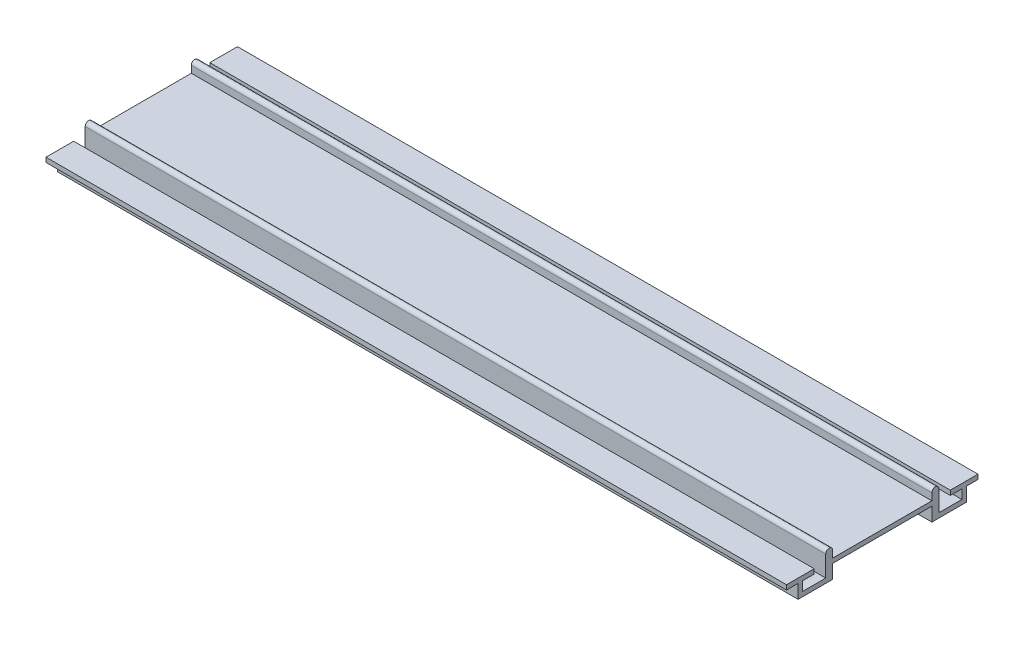
ISO-10303-21;
HEADER;
FILE_DESCRIPTION(('STEP AP214'),'2;1');
FILE_NAME('part.step','',(''),(''),'','','');
FILE_SCHEMA(('AUTOMOTIVE_DESIGN { 1 0 10303 214 1 1 1 1 }'));
ENDSEC;
DATA;
#1=APPLICATION_CONTEXT('core data for automotive mechanical design processes');
#2=APPLICATION_PROTOCOL_DEFINITION('international standard','automotive_design',2000,#1);
#3=PRODUCT_CONTEXT('',#1,'mechanical');
#4=PRODUCT('Part','Part','',(#3));
#5=PRODUCT_RELATED_PRODUCT_CATEGORY('part','',(#4));
#6=PRODUCT_DEFINITION_FORMATION('','',#4);
#7=PRODUCT_DEFINITION_CONTEXT('part definition',#1,'design');
#8=PRODUCT_DEFINITION('design','',#6,#7);
#9=PRODUCT_DEFINITION_SHAPE('','',#8);
#10=(LENGTH_UNIT() NAMED_UNIT(*) SI_UNIT(.MILLI.,.METRE.));
#11=(NAMED_UNIT(*) PLANE_ANGLE_UNIT() SI_UNIT($,.RADIAN.));
#12=(NAMED_UNIT(*) SI_UNIT($,.STERADIAN.) SOLID_ANGLE_UNIT());
#13=UNCERTAINTY_MEASURE_WITH_UNIT(LENGTH_MEASURE(1.E-05),#10,'distance_accuracy_value','');
#14=(GEOMETRIC_REPRESENTATION_CONTEXT(3) GLOBAL_UNCERTAINTY_ASSIGNED_CONTEXT((#13)) GLOBAL_UNIT_ASSIGNED_CONTEXT((#10,
#11,#12)) REPRESENTATION_CONTEXT('',''));
#15=CARTESIAN_POINT('',(0.,0.,0.));
#16=DIRECTION('',(0.,0.,1.));
#17=DIRECTION('',(1.,0.,0.));
#18=AXIS2_PLACEMENT_3D('',#15,#16,#17);
#19=CARTESIAN_POINT('',(368.894917120642,15.3157017452683,-221.556360518351));
#20=DIRECTION('',(0.,0.,1.));
#21=DIRECTION('',(1.,0.,0.));
#22=AXIS2_PLACEMENT_3D('',#19,#20,#21);
#23=PLANE('',#22);
#24=DIRECTION('',(0.,1.,0.));
#25=VECTOR('',#24,1.);
#26=CARTESIAN_POINT('',(689.894917120642,69.9291697379944,-221.556360518351));
#27=LINE('',#26,#25);
#28=CARTESIAN_POINT('',(689.894917120642,15.3157017452683,-221.556360518351));
#29=VERTEX_POINT('',#28);
#30=CARTESIAN_POINT('',(689.894917120642,24.3157017452683,-221.556360518351));
#31=VERTEX_POINT('',#30);
#32=EDGE_CURVE('E89',#29,#31,#27,.T.);
#33=ORIENTED_EDGE('',*,*,#32,.T.);
#34=DIRECTION('',(1.,0.,0.));
#35=VECTOR('',#34,1.);
#36=CARTESIAN_POINT('',(368.894917120642,24.3157017452683,-221.556360518351));
#37=LINE('',#36,#35);
#38=CARTESIAN_POINT('',(368.894917120642,24.3157017452683,-221.556360518351));
#39=VERTEX_POINT('',#38);
#40=EDGE_CURVE('E83',#39,#31,#37,.T.);
#41=ORIENTED_EDGE('',*,*,#40,.F.);
#42=DIRECTION('',(0.,1.,0.));
#43=VECTOR('',#42,1.);
#44=CARTESIAN_POINT('',(368.894917120642,47.3427553532076,-221.556360518351));
#45=LINE('',#44,#43);
#46=CARTESIAN_POINT('',(368.894917120642,15.3157017452683,-221.556360518351));
#47=VERTEX_POINT('',#46);
#48=EDGE_CURVE('E86',#47,#39,#45,.T.);
#49=ORIENTED_EDGE('',*,*,#48,.F.);
#50=DIRECTION('',(1.,0.,0.));
#51=VECTOR('',#50,1.);
#52=CARTESIAN_POINT('',(368.894917120642,15.3157017452683,-221.556360518351));
#53=LINE('',#52,#51);
#54=EDGE_CURVE('E109',#29,#47,#53,.F.);
#55=ORIENTED_EDGE('',*,*,#54,.F.);
#56=EDGE_LOOP('',(#33,#41,#49,#55));
#57=FACE_BOUND('',#56,.T.);
#58=ADVANCED_FACE('F17',(#57),#23,.T.);
#59=CARTESIAN_POINT('',(368.894917120642,24.3157017452683,-223.056360518351));
#60=DIRECTION('',(1.,0.,0.));
#61=DIRECTION('',(0.,0.,-1.));
#62=AXIS2_PLACEMENT_3D('',#59,#60,#61);
#63=CYLINDRICAL_SURFACE('',#62,1.5);
#64=CARTESIAN_POINT('',(689.894917120642,24.3157017452683,-223.056360518351));
#65=DIRECTION('',(1.,0.,0.));
#66=DIRECTION('',(0.,0.,-1.));
#67=AXIS2_PLACEMENT_3D('',#64,#65,#66);
#68=CIRCLE('',#67,1.5);
#69=CARTESIAN_POINT('',(689.894917120642,24.3157017452683,-224.556360518351));
#70=VERTEX_POINT('',#69);
#71=EDGE_CURVE('E244',#31,#70,#68,.F.);
#72=ORIENTED_EDGE('',*,*,#71,.T.);
#73=DIRECTION('',(-1.,0.,0.));
#74=VECTOR('',#73,1.);
#75=CARTESIAN_POINT('',(368.894917120642,24.3157017452683,-224.556360518351));
#76=LINE('',#75,#74);
#77=CARTESIAN_POINT('',(368.894917120642,24.3157017452683,-224.556360518351));
#78=VERTEX_POINT('',#77);
#79=EDGE_CURVE('E98',#78,#70,#76,.F.);
#80=ORIENTED_EDGE('',*,*,#79,.F.);
#81=CARTESIAN_POINT('',(368.894917120642,24.3157017452683,-223.056360518351));
#82=DIRECTION('',(1.,0.,0.));
#83=DIRECTION('',(0.,0.,-1.));
#84=AXIS2_PLACEMENT_3D('',#81,#82,#83);
#85=CIRCLE('',#84,1.5);
#86=EDGE_CURVE('E20',#39,#78,#85,.F.);
#87=ORIENTED_EDGE('',*,*,#86,.F.);
#88=ORIENTED_EDGE('',*,*,#40,.T.);
#89=EDGE_LOOP('',(#72,#80,#87,#88));
#90=FACE_BOUND('',#89,.T.);
#91=ADVANCED_FACE('F96',(#90),#63,.T.);
#92=CARTESIAN_POINT('',(368.894917120642,24.3157017452683,-270.556360518351));
#93=DIRECTION('',(0.,0.,-1.));
#94=DIRECTION('',(-1.,0.,0.));
#95=AXIS2_PLACEMENT_3D('',#92,#93,#94);
#96=PLANE('',#95);
#97=DIRECTION('',(0.,1.,0.));
#98=VECTOR('',#97,1.);
#99=CARTESIAN_POINT('',(689.894917120642,69.9291697379944,-270.556360518351));
#100=LINE('',#99,#98);
#101=CARTESIAN_POINT('',(689.894917120642,24.3157017452683,-270.556360518351));
#102=VERTEX_POINT('',#101);
#103=CARTESIAN_POINT('',(689.894917120642,15.3157017452683,-270.556360518351));
#104=VERTEX_POINT('',#103);
#105=EDGE_CURVE('E209',#102,#104,#100,.F.);
#106=ORIENTED_EDGE('',*,*,#105,.T.);
#107=DIRECTION('',(1.,0.,0.));
#108=VECTOR('',#107,1.);
#109=CARTESIAN_POINT('',(368.894917120642,15.3157017452683,-270.556360518351));
#110=LINE('',#109,#108);
#111=CARTESIAN_POINT('',(368.894917120642,15.3157017452683,-270.556360518351));
#112=VERTEX_POINT('',#111);
#113=EDGE_CURVE('E92',#112,#104,#110,.T.);
#114=ORIENTED_EDGE('',*,*,#113,.F.);
#115=DIRECTION('',(0.,1.,0.));
#116=VECTOR('',#115,1.);
#117=CARTESIAN_POINT('',(368.894917120642,47.3427553532076,-270.556360518351));
#118=LINE('',#117,#116);
#119=CARTESIAN_POINT('',(368.894917120642,24.3157017452683,-270.556360518351));
#120=VERTEX_POINT('',#119);
#121=EDGE_CURVE('E233',#120,#112,#118,.F.);
#122=ORIENTED_EDGE('',*,*,#121,.F.);
#123=DIRECTION('',(-1.,0.,0.));
#124=VECTOR('',#123,1.);
#125=CARTESIAN_POINT('',(368.894917120642,24.3157017452683,-270.556360518351));
#126=LINE('',#125,#124);
#127=EDGE_CURVE('E107',#102,#120,#126,.T.);
#128=ORIENTED_EDGE('',*,*,#127,.F.);
#129=EDGE_LOOP('',(#106,#114,#122,#128));
#130=FACE_BOUND('',#129,.T.);
#131=ADVANCED_FACE('F487',(#130),#96,.T.);
#132=CARTESIAN_POINT('',(368.894917120642,15.3157017452683,-270.556360518351));
#133=DIRECTION('',(0.,1.,0.));
#134=DIRECTION('',(0.,0.,1.));
#135=AXIS2_PLACEMENT_3D('',#132,#133,#134);
#136=PLANE('',#135);
#137=DIRECTION('',(0.,0.,1.));
#138=VECTOR('',#137,1.);
#139=CARTESIAN_POINT('',(689.894917120642,15.3157017452683,-269.960616829488));
#140=LINE('',#139,#138);
#141=CARTESIAN_POINT('',(689.894917120642,15.3157017452683,-280.556360518351));
#142=VERTEX_POINT('',#141);
#143=EDGE_CURVE('E205',#104,#142,#140,.F.);
#144=ORIENTED_EDGE('',*,*,#143,.T.);
#145=DIRECTION('',(1.,0.,0.));
#146=VECTOR('',#145,1.);
#147=CARTESIAN_POINT('',(368.894917120642,15.3157017452683,-280.556360518351));
#148=LINE('',#147,#146);
#149=CARTESIAN_POINT('',(368.894917120642,15.3157017452683,-280.556360518351));
#150=VERTEX_POINT('',#149);
#151=EDGE_CURVE('E198',#150,#142,#148,.T.);
#152=ORIENTED_EDGE('',*,*,#151,.F.);
#153=DIRECTION('',(0.,0.,1.));
#154=VECTOR('',#153,1.);
#155=CARTESIAN_POINT('',(368.894917120642,15.3157017452683,-260.982912896032));
#156=LINE('',#155,#154);
#157=EDGE_CURVE('E229',#112,#150,#156,.F.);
#158=ORIENTED_EDGE('',*,*,#157,.F.);
#159=ORIENTED_EDGE('',*,*,#113,.T.);
#160=EDGE_LOOP('',(#144,#152,#158,#159));
#161=FACE_BOUND('',#160,.T.);
#162=ADVANCED_FACE('F483',(#161),#136,.T.);
#163=CARTESIAN_POINT('',(368.894917120642,15.3157017452683,-280.556360518351));
#164=DIRECTION('',(0.,0.,1.));
#165=DIRECTION('',(1.,0.,0.));
#166=AXIS2_PLACEMENT_3D('',#163,#164,#165);
#167=PLANE('',#166);
#168=DIRECTION('',(0.,1.,0.));
#169=VECTOR('',#168,1.);
#170=CARTESIAN_POINT('',(689.894917120642,69.9291697379944,-280.556360518351));
#171=LINE('',#170,#169);
#172=CARTESIAN_POINT('',(689.894917120642,19.3157017452683,-280.556360518351));
#173=VERTEX_POINT('',#172);
#174=EDGE_CURVE('E208',#142,#173,#171,.T.);
#175=ORIENTED_EDGE('',*,*,#174,.T.);
#176=DIRECTION('',(1.,0.,0.));
#177=VECTOR('',#176,1.);
#178=CARTESIAN_POINT('',(368.894917120642,19.3157017452683,-280.556360518351));
#179=LINE('',#178,#177);
#180=CARTESIAN_POINT('',(368.894917120642,19.3157017452683,-280.556360518351));
#181=VERTEX_POINT('',#180);
#182=EDGE_CURVE('E195',#181,#173,#179,.T.);
#183=ORIENTED_EDGE('',*,*,#182,.F.);
#184=DIRECTION('',(0.,1.,0.));
#185=VECTOR('',#184,1.);
#186=CARTESIAN_POINT('',(368.894917120642,47.3427553532076,-280.556360518351));
#187=LINE('',#186,#185);
#188=EDGE_CURVE('E232',#150,#181,#187,.T.);
#189=ORIENTED_EDGE('',*,*,#188,.F.);
#190=ORIENTED_EDGE('',*,*,#151,.T.);
#191=EDGE_LOOP('',(#175,#183,#189,#190));
#192=FACE_BOUND('',#191,.T.);
#193=ADVANCED_FACE('F479',(#192),#167,.T.);
#194=CARTESIAN_POINT('',(368.894917120642,19.3157017452683,-280.556360518351));
#195=DIRECTION('',(0.,-1.,0.));
#196=DIRECTION('',(0.,0.,-1.));
#197=AXIS2_PLACEMENT_3D('',#194,#195,#196);
#198=PLANE('',#197);
#199=DIRECTION('',(0.,0.,1.));
#200=VECTOR('',#199,1.);
#201=CARTESIAN_POINT('',(689.894917120642,19.3157017452683,-269.960616829488));
#202=LINE('',#201,#200);
#203=CARTESIAN_POINT('',(689.894917120642,19.3157017452683,-275.556360518351));
#204=VERTEX_POINT('',#203);
#205=EDGE_CURVE('E315',#173,#204,#202,.T.);
#206=ORIENTED_EDGE('',*,*,#205,.T.);
#207=DIRECTION('',(1.,0.,0.));
#208=VECTOR('',#207,1.);
#209=CARTESIAN_POINT('',(368.894917120642,19.3157017452683,-275.556360518351));
#210=LINE('',#209,#208);
#211=CARTESIAN_POINT('',(368.894917120642,19.3157017452683,-275.556360518351));
#212=VERTEX_POINT('',#211);
#213=EDGE_CURVE('E192',#212,#204,#210,.T.);
#214=ORIENTED_EDGE('',*,*,#213,.F.);
#215=DIRECTION('',(0.,0.,1.));
#216=VECTOR('',#215,1.);
#217=CARTESIAN_POINT('',(368.894917120642,19.3157017452683,-260.982912896032));
#218=LINE('',#217,#216);
#219=EDGE_CURVE('E252',#181,#212,#218,.T.);
#220=ORIENTED_EDGE('',*,*,#219,.F.);
#221=ORIENTED_EDGE('',*,*,#182,.T.);
#222=EDGE_LOOP('',(#206,#214,#220,#221));
#223=FACE_BOUND('',#222,.T.);
#224=ADVANCED_FACE('F475',(#223),#198,.T.);
#225=CARTESIAN_POINT('',(368.894917120642,19.3157017452683,-275.556360518351));
#226=DIRECTION('',(0.,0.,1.));
#227=DIRECTION('',(1.,0.,0.));
#228=AXIS2_PLACEMENT_3D('',#225,#226,#227);
#229=PLANE('',#228);
#230=DIRECTION('',(0.,1.,0.));
#231=VECTOR('',#230,1.);
#232=CARTESIAN_POINT('',(689.894917120642,69.9291697379944,-275.556360518351));
#233=LINE('',#232,#231);
#234=CARTESIAN_POINT('',(689.894917120642,21.3157017452683,-275.556360518351));
#235=VERTEX_POINT('',#234);
#236=EDGE_CURVE('E318',#204,#235,#233,.T.);
#237=ORIENTED_EDGE('',*,*,#236,.T.);
#238=DIRECTION('',(1.,0.,0.));
#239=VECTOR('',#238,1.);
#240=CARTESIAN_POINT('',(368.894917120642,21.3157017452683,-275.556360518351));
#241=LINE('',#240,#239);
#242=CARTESIAN_POINT('',(368.894917120642,21.3157017452683,-275.556360518351));
#243=VERTEX_POINT('',#242);
#244=EDGE_CURVE('E189',#243,#235,#241,.T.);
#245=ORIENTED_EDGE('',*,*,#244,.F.);
#246=DIRECTION('',(0.,1.,0.));
#247=VECTOR('',#246,1.);
#248=CARTESIAN_POINT('',(368.894917120642,47.3427553532076,-275.556360518351));
#249=LINE('',#248,#247);
#250=EDGE_CURVE('E255',#212,#243,#249,.T.);
#251=ORIENTED_EDGE('',*,*,#250,.F.);
#252=ORIENTED_EDGE('',*,*,#213,.T.);
#253=EDGE_LOOP('',(#237,#245,#251,#252));
#254=FACE_BOUND('',#253,.T.);
#255=ADVANCED_FACE('F471',(#254),#229,.T.);
#256=CARTESIAN_POINT('',(368.894917120642,21.3157017452683,-275.556360518351));
#257=DIRECTION('',(0.,1.,0.));
#258=DIRECTION('',(0.,0.,1.));
#259=AXIS2_PLACEMENT_3D('',#256,#257,#258);
#260=PLANE('',#259);
#261=DIRECTION('',(0.,0.,1.));
#262=VECTOR('',#261,1.);
#263=CARTESIAN_POINT('',(689.894917120642,21.3157017452683,-269.960616829488));
#264=LINE('',#263,#262);
#265=CARTESIAN_POINT('',(689.894917120642,21.3157017452683,-287.556360518351));
#266=VERTEX_POINT('',#265);
#267=EDGE_CURVE('E321',#235,#266,#264,.F.);
#268=ORIENTED_EDGE('',*,*,#267,.T.);
#269=DIRECTION('',(-1.,0.,0.));
#270=VECTOR('',#269,1.);
#271=CARTESIAN_POINT('',(368.894917120642,21.3157017452683,-287.556360518351));
#272=LINE('',#271,#270);
#273=CARTESIAN_POINT('',(368.894917120642,21.3157017452683,-287.556360518351));
#274=VERTEX_POINT('',#273);
#275=EDGE_CURVE('E186',#274,#266,#272,.F.);
#276=ORIENTED_EDGE('',*,*,#275,.F.);
#277=DIRECTION('',(0.,0.,1.));
#278=VECTOR('',#277,1.);
#279=CARTESIAN_POINT('',(368.894917120642,21.3157017452683,-260.982912896032));
#280=LINE('',#279,#278);
#281=EDGE_CURVE('E258',#243,#274,#280,.F.);
#282=ORIENTED_EDGE('',*,*,#281,.F.);
#283=ORIENTED_EDGE('',*,*,#244,.T.);
#284=EDGE_LOOP('',(#268,#276,#282,#283));
#285=FACE_BOUND('',#284,.T.);
#286=ADVANCED_FACE('F467',(#285),#260,.T.);
#287=CARTESIAN_POINT('',(368.894917120642,21.3157017452683,-287.556360518351));
#288=DIRECTION('',(0.,0.,-1.));
#289=DIRECTION('',(-1.,0.,0.));
#290=AXIS2_PLACEMENT_3D('',#287,#288,#289);
#291=PLANE('',#290);
#292=DIRECTION('',(0.,1.,0.));
#293=VECTOR('',#292,1.);
#294=CARTESIAN_POINT('',(689.894917120642,69.9291697379944,-287.556360518351));
#295=LINE('',#294,#293);
#296=CARTESIAN_POINT('',(689.894917120642,19.3157017452683,-287.556360518351));
#297=VERTEX_POINT('',#296);
#298=EDGE_CURVE('E324',#266,#297,#295,.F.);
#299=ORIENTED_EDGE('',*,*,#298,.T.);
#300=DIRECTION('',(1.,0.,0.));
#301=VECTOR('',#300,1.);
#302=CARTESIAN_POINT('',(368.894917120642,19.3157017452683,-287.556360518351));
#303=LINE('',#302,#301);
#304=CARTESIAN_POINT('',(368.894917120642,19.3157017452683,-287.556360518351));
#305=VERTEX_POINT('',#304);
#306=EDGE_CURVE('E183',#305,#297,#303,.T.);
#307=ORIENTED_EDGE('',*,*,#306,.F.);
#308=DIRECTION('',(0.,1.,0.));
#309=VECTOR('',#308,1.);
#310=CARTESIAN_POINT('',(368.894917120642,47.3427553532076,-287.556360518351));
#311=LINE('',#310,#309);
#312=EDGE_CURVE('E261',#274,#305,#311,.F.);
#313=ORIENTED_EDGE('',*,*,#312,.F.);
#314=ORIENTED_EDGE('',*,*,#275,.T.);
#315=EDGE_LOOP('',(#299,#307,#313,#314));
#316=FACE_BOUND('',#315,.T.);
#317=ADVANCED_FACE('F463',(#316),#291,.T.);
#318=CARTESIAN_POINT('',(368.894917120642,19.3157017452683,-287.556360518351));
#319=DIRECTION('',(0.,-1.,0.));
#320=DIRECTION('',(0.,0.,-1.));
#321=AXIS2_PLACEMENT_3D('',#318,#319,#320);
#322=PLANE('',#321);
#323=DIRECTION('',(0.,0.,1.));
#324=VECTOR('',#323,1.);
#325=CARTESIAN_POINT('',(689.894917120642,19.3157017452683,-269.960616829488));
#326=LINE('',#325,#324);
#327=CARTESIAN_POINT('',(689.894917120642,19.3157017452683,-282.556360518351));
#328=VERTEX_POINT('',#327);
#329=EDGE_CURVE('E327',#297,#328,#326,.T.);
#330=ORIENTED_EDGE('',*,*,#329,.T.);
#331=DIRECTION('',(-1.,0.,0.));
#332=VECTOR('',#331,1.);
#333=CARTESIAN_POINT('',(368.894917120642,19.3157017452683,-282.556360518351));
#334=LINE('',#333,#332);
#335=CARTESIAN_POINT('',(368.894917120642,19.3157017452683,-282.556360518351));
#336=VERTEX_POINT('',#335);
#337=EDGE_CURVE('E180',#336,#328,#334,.F.);
#338=ORIENTED_EDGE('',*,*,#337,.F.);
#339=DIRECTION('',(0.,0.,1.));
#340=VECTOR('',#339,1.);
#341=CARTESIAN_POINT('',(368.894917120642,19.3157017452683,-260.982912896032));
#342=LINE('',#341,#340);
#343=EDGE_CURVE('E264',#305,#336,#342,.T.);
#344=ORIENTED_EDGE('',*,*,#343,.F.);
#345=ORIENTED_EDGE('',*,*,#306,.T.);
#346=EDGE_LOOP('',(#330,#338,#344,#345));
#347=FACE_BOUND('',#346,.T.);
#348=ADVANCED_FACE('F459',(#347),#322,.T.);
#349=CARTESIAN_POINT('',(368.894917120642,19.3157017452683,-282.556360518351));
#350=DIRECTION('',(0.,0.,-1.));
#351=DIRECTION('',(-1.,0.,0.));
#352=AXIS2_PLACEMENT_3D('',#349,#350,#351);
#353=PLANE('',#352);
#354=DIRECTION('',(0.,1.,0.));
#355=VECTOR('',#354,1.);
#356=CARTESIAN_POINT('',(689.894917120642,69.9291697379944,-282.556360518351));
#357=LINE('',#356,#355);
#358=CARTESIAN_POINT('',(689.894917120642,13.3157017452683,-282.556360518351));
#359=VERTEX_POINT('',#358);
#360=EDGE_CURVE('E330',#328,#359,#357,.F.);
#361=ORIENTED_EDGE('',*,*,#360,.T.);
#362=DIRECTION('',(1.,0.,0.));
#363=VECTOR('',#362,1.);
#364=CARTESIAN_POINT('',(368.894917120642,13.3157017452683,-282.556360518351));
#365=LINE('',#364,#363);
#366=CARTESIAN_POINT('',(368.894917120642,13.3157017452683,-282.556360518351));
#367=VERTEX_POINT('',#366);
#368=EDGE_CURVE('E177',#367,#359,#365,.T.);
#369=ORIENTED_EDGE('',*,*,#368,.F.);
#370=DIRECTION('',(0.,1.,0.));
#371=VECTOR('',#370,1.);
#372=CARTESIAN_POINT('',(368.894917120642,47.3427553532076,-282.556360518351));
#373=LINE('',#372,#371);
#374=EDGE_CURVE('E267',#336,#367,#373,.F.);
#375=ORIENTED_EDGE('',*,*,#374,.F.);
#376=ORIENTED_EDGE('',*,*,#337,.T.);
#377=EDGE_LOOP('',(#361,#369,#375,#376));
#378=FACE_BOUND('',#377,.T.);
#379=ADVANCED_FACE('F455',(#378),#353,.T.);
#380=CARTESIAN_POINT('',(368.894917120642,13.3157017452683,-282.556360518351));
#381=DIRECTION('',(0.,-1.,0.));
#382=DIRECTION('',(0.,0.,-1.));
#383=AXIS2_PLACEMENT_3D('',#380,#381,#382);
#384=PLANE('',#383);
#385=DIRECTION('',(0.,0.,1.));
#386=VECTOR('',#385,1.);
#387=CARTESIAN_POINT('',(689.894917120642,13.3157017452683,-269.960616829488));
#388=LINE('',#387,#386);
#389=CARTESIAN_POINT('',(689.894917120642,13.3157017452683,-267.556360518351));
#390=VERTEX_POINT('',#389);
#391=EDGE_CURVE('E333',#359,#390,#388,.T.);
#392=ORIENTED_EDGE('',*,*,#391,.T.);
#393=DIRECTION('',(1.,0.,0.));
#394=VECTOR('',#393,1.);
#395=CARTESIAN_POINT('',(368.894917120642,13.3157017452683,-267.556360518351));
#396=LINE('',#395,#394);
#397=CARTESIAN_POINT('',(368.894917120642,13.3157017452683,-267.556360518351));
#398=VERTEX_POINT('',#397);
#399=EDGE_CURVE('E174',#398,#390,#396,.T.);
#400=ORIENTED_EDGE('',*,*,#399,.F.);
#401=DIRECTION('',(0.,0.,1.));
#402=VECTOR('',#401,1.);
#403=CARTESIAN_POINT('',(368.894917120642,13.3157017452683,-260.982912896032));
#404=LINE('',#403,#402);
#405=EDGE_CURVE('E270',#367,#398,#404,.T.);
#406=ORIENTED_EDGE('',*,*,#405,.F.);
#407=ORIENTED_EDGE('',*,*,#368,.T.);
#408=EDGE_LOOP('',(#392,#400,#406,#407));
#409=FACE_BOUND('',#408,.T.);
#410=ADVANCED_FACE('F451',(#409),#384,.T.);
#411=CARTESIAN_POINT('',(368.894917120642,13.3157017452683,-267.556360518351));
#412=DIRECTION('',(0.,0.,1.));
#413=DIRECTION('',(1.,0.,0.));
#414=AXIS2_PLACEMENT_3D('',#411,#412,#413);
#415=PLANE('',#414);
#416=DIRECTION('',(0.,1.,0.));
#417=VECTOR('',#416,1.);
#418=CARTESIAN_POINT('',(689.894917120642,69.9291697379944,-267.556360518351));
#419=LINE('',#418,#417);
#420=CARTESIAN_POINT('',(689.894917120642,19.3157017452683,-267.556360518351));
#421=VERTEX_POINT('',#420);
#422=EDGE_CURVE('E336',#390,#421,#419,.T.);
#423=ORIENTED_EDGE('',*,*,#422,.T.);
#424=DIRECTION('',(1.,0.,0.));
#425=VECTOR('',#424,1.);
#426=CARTESIAN_POINT('',(368.894917120642,19.3157017452683,-267.556360518351));
#427=LINE('',#426,#425);
#428=CARTESIAN_POINT('',(368.894917120642,19.3157017452683,-267.556360518351));
#429=VERTEX_POINT('',#428);
#430=EDGE_CURVE('E171',#429,#421,#427,.T.);
#431=ORIENTED_EDGE('',*,*,#430,.F.);
#432=DIRECTION('',(0.,1.,0.));
#433=VECTOR('',#432,1.);
#434=CARTESIAN_POINT('',(368.894917120642,47.3427553532076,-267.556360518351));
#435=LINE('',#434,#433);
#436=EDGE_CURVE('E273',#398,#429,#435,.T.);
#437=ORIENTED_EDGE('',*,*,#436,.F.);
#438=ORIENTED_EDGE('',*,*,#399,.T.);
#439=EDGE_LOOP('',(#423,#431,#437,#438));
#440=FACE_BOUND('',#439,.T.);
#441=ADVANCED_FACE('F447',(#440),#415,.T.);
#442=CARTESIAN_POINT('',(368.894917120642,19.3157017452683,-246.056360518351));
#443=DIRECTION('',(0.,-1.,0.));
#444=DIRECTION('',(0.,0.,-1.));
#445=AXIS2_PLACEMENT_3D('',#442,#443,#444);
#446=PLANE('',#445);
#447=DIRECTION('',(0.,0.,1.));
#448=VECTOR('',#447,1.);
#449=CARTESIAN_POINT('',(689.894917120642,19.3157017452683,-269.960616829488));
#450=LINE('',#449,#448);
#451=CARTESIAN_POINT('',(689.894917120642,19.3157017452683,-224.556360518351));
#452=VERTEX_POINT('',#451);
#453=EDGE_CURVE('E339',#421,#452,#450,.T.);
#454=ORIENTED_EDGE('',*,*,#453,.T.);
#455=DIRECTION('',(-1.,0.,0.));
#456=VECTOR('',#455,1.);
#457=CARTESIAN_POINT('',(368.894917120642,19.3157017452683,-224.556360518351));
#458=LINE('',#457,#456);
#459=CARTESIAN_POINT('',(368.894917120642,19.3157017452683,-224.556360518351));
#460=VERTEX_POINT('',#459);
#461=EDGE_CURVE('E168',#460,#452,#458,.F.);
#462=ORIENTED_EDGE('',*,*,#461,.F.);
#463=DIRECTION('',(0.,0.,1.));
#464=VECTOR('',#463,1.);
#465=CARTESIAN_POINT('',(368.894917120642,19.3157017452683,-260.982912896032));
#466=LINE('',#465,#464);
#467=EDGE_CURVE('E276',#429,#460,#466,.T.);
#468=ORIENTED_EDGE('',*,*,#467,.F.);
#469=ORIENTED_EDGE('',*,*,#430,.T.);
#470=EDGE_LOOP('',(#454,#462,#468,#469));
#471=FACE_BOUND('',#470,.T.);
#472=ADVANCED_FACE('F443',(#471),#446,.T.);
#473=CARTESIAN_POINT('',(368.894917120642,19.3157017452683,-224.556360518351));
#474=DIRECTION('',(0.,0.,-1.));
#475=DIRECTION('',(-1.,0.,0.));
#476=AXIS2_PLACEMENT_3D('',#473,#474,#475);
#477=PLANE('',#476);
#478=DIRECTION('',(0.,1.,0.));
#479=VECTOR('',#478,1.);
#480=CARTESIAN_POINT('',(689.894917120642,69.9291697379944,-224.556360518351));
#481=LINE('',#480,#479);
#482=CARTESIAN_POINT('',(689.894917120642,13.3157017452683,-224.556360518351));
#483=VERTEX_POINT('',#482);
#484=EDGE_CURVE('E342',#452,#483,#481,.F.);
#485=ORIENTED_EDGE('',*,*,#484,.T.);
#486=DIRECTION('',(1.,0.,0.));
#487=VECTOR('',#486,1.);
#488=CARTESIAN_POINT('',(368.894917120642,13.3157017452683,-224.556360518351));
#489=LINE('',#488,#487);
#490=CARTESIAN_POINT('',(368.894917120642,13.3157017452683,-224.556360518351));
#491=VERTEX_POINT('',#490);
#492=EDGE_CURVE('E165',#491,#483,#489,.T.);
#493=ORIENTED_EDGE('',*,*,#492,.F.);
#494=DIRECTION('',(0.,1.,0.));
#495=VECTOR('',#494,1.);
#496=CARTESIAN_POINT('',(368.894917120642,47.3427553532076,-224.556360518351));
#497=LINE('',#496,#495);
#498=EDGE_CURVE('E279',#460,#491,#497,.F.);
#499=ORIENTED_EDGE('',*,*,#498,.F.);
#500=ORIENTED_EDGE('',*,*,#461,.T.);
#501=EDGE_LOOP('',(#485,#493,#499,#500));
#502=FACE_BOUND('',#501,.T.);
#503=ADVANCED_FACE('F439',(#502),#477,.T.);
#504=CARTESIAN_POINT('',(368.894917120642,13.3157017452683,-224.556360518351));
#505=DIRECTION('',(0.,-1.,0.));
#506=DIRECTION('',(0.,0.,-1.));
#507=AXIS2_PLACEMENT_3D('',#504,#505,#506);
#508=PLANE('',#507);
#509=DIRECTION('',(0.,0.,1.));
#510=VECTOR('',#509,1.);
#511=CARTESIAN_POINT('',(689.894917120642,13.3157017452683,-269.960616829488));
#512=LINE('',#511,#510);
#513=CARTESIAN_POINT('',(689.894917120642,13.3157017452683,-209.556360518351));
#514=VERTEX_POINT('',#513);
#515=EDGE_CURVE('E345',#483,#514,#512,.T.);
#516=ORIENTED_EDGE('',*,*,#515,.T.);
#517=DIRECTION('',(1.,0.,0.));
#518=VECTOR('',#517,1.);
#519=CARTESIAN_POINT('',(368.894917120642,13.3157017452683,-209.556360518351));
#520=LINE('',#519,#518);
#521=CARTESIAN_POINT('',(368.894917120642,13.3157017452683,-209.556360518351));
#522=VERTEX_POINT('',#521);
#523=EDGE_CURVE('E162',#522,#514,#520,.T.);
#524=ORIENTED_EDGE('',*,*,#523,.F.);
#525=DIRECTION('',(0.,0.,1.));
#526=VECTOR('',#525,1.);
#527=CARTESIAN_POINT('',(368.894917120642,13.3157017452683,-260.982912896032));
#528=LINE('',#527,#526);
#529=EDGE_CURVE('E282',#491,#522,#528,.T.);
#530=ORIENTED_EDGE('',*,*,#529,.F.);
#531=ORIENTED_EDGE('',*,*,#492,.T.);
#532=EDGE_LOOP('',(#516,#524,#530,#531));
#533=FACE_BOUND('',#532,.T.);
#534=ADVANCED_FACE('F435',(#533),#508,.T.);
#535=CARTESIAN_POINT('',(368.894917120642,13.3157017452683,-209.556360518351));
#536=DIRECTION('',(0.,0.,1.));
#537=DIRECTION('',(1.,0.,0.));
#538=AXIS2_PLACEMENT_3D('',#535,#536,#537);
#539=PLANE('',#538);
#540=DIRECTION('',(0.,1.,0.));
#541=VECTOR('',#540,1.);
#542=CARTESIAN_POINT('',(689.894917120642,69.9291697379944,-209.556360518351));
#543=LINE('',#542,#541);
#544=CARTESIAN_POINT('',(689.894917120642,19.3157017452683,-209.556360518351));
#545=VERTEX_POINT('',#544);
#546=EDGE_CURVE('E348',#514,#545,#543,.T.);
#547=ORIENTED_EDGE('',*,*,#546,.T.);
#548=DIRECTION('',(1.,0.,0.));
#549=VECTOR('',#548,1.);
#550=CARTESIAN_POINT('',(368.894917120642,19.3157017452683,-209.556360518351));
#551=LINE('',#550,#549);
#552=CARTESIAN_POINT('',(368.894917120642,19.3157017452683,-209.556360518351));
#553=VERTEX_POINT('',#552);
#554=EDGE_CURVE('E159',#553,#545,#551,.T.);
#555=ORIENTED_EDGE('',*,*,#554,.F.);
#556=DIRECTION('',(0.,1.,0.));
#557=VECTOR('',#556,1.);
#558=CARTESIAN_POINT('',(368.894917120642,47.3427553532076,-209.556360518351));
#559=LINE('',#558,#557);
#560=EDGE_CURVE('E285',#522,#553,#559,.T.);
#561=ORIENTED_EDGE('',*,*,#560,.F.);
#562=ORIENTED_EDGE('',*,*,#523,.T.);
#563=EDGE_LOOP('',(#547,#555,#561,#562));
#564=FACE_BOUND('',#563,.T.);
#565=ADVANCED_FACE('F431',(#564),#539,.T.);
#566=CARTESIAN_POINT('',(368.894917120642,19.3157017452683,-209.556360518351));
#567=DIRECTION('',(0.,-1.,0.));
#568=DIRECTION('',(0.,0.,-1.));
#569=AXIS2_PLACEMENT_3D('',#566,#567,#568);
#570=PLANE('',#569);
#571=DIRECTION('',(0.,0.,1.));
#572=VECTOR('',#571,1.);
#573=CARTESIAN_POINT('',(689.894917120642,19.3157017452683,-269.960616829488));
#574=LINE('',#573,#572);
#575=CARTESIAN_POINT('',(689.894917120642,19.3157017452683,-204.556360518351));
#576=VERTEX_POINT('',#575);
#577=EDGE_CURVE('E351',#545,#576,#574,.T.);
#578=ORIENTED_EDGE('',*,*,#577,.T.);
#579=DIRECTION('',(1.,0.,0.));
#580=VECTOR('',#579,1.);
#581=CARTESIAN_POINT('',(368.894917120642,19.3157017452683,-204.556360518351));
#582=LINE('',#581,#580);
#583=CARTESIAN_POINT('',(368.894917120642,19.3157017452683,-204.556360518351));
#584=VERTEX_POINT('',#583);
#585=EDGE_CURVE('E156',#584,#576,#582,.T.);
#586=ORIENTED_EDGE('',*,*,#585,.F.);
#587=DIRECTION('',(0.,0.,1.));
#588=VECTOR('',#587,1.);
#589=CARTESIAN_POINT('',(368.894917120642,19.3157017452683,-260.982912896032));
#590=LINE('',#589,#588);
#591=EDGE_CURVE('E288',#553,#584,#590,.T.);
#592=ORIENTED_EDGE('',*,*,#591,.F.);
#593=ORIENTED_EDGE('',*,*,#554,.T.);
#594=EDGE_LOOP('',(#578,#586,#592,#593));
#595=FACE_BOUND('',#594,.T.);
#596=ADVANCED_FACE('F427',(#595),#570,.T.);
#597=CARTESIAN_POINT('',(368.894917120642,19.3157017452683,-204.556360518351));
#598=DIRECTION('',(0.,0.,1.));
#599=DIRECTION('',(1.,0.,0.));
#600=AXIS2_PLACEMENT_3D('',#597,#598,#599);
#601=PLANE('',#600);
#602=DIRECTION('',(0.,1.,0.));
#603=VECTOR('',#602,1.);
#604=CARTESIAN_POINT('',(689.894917120642,69.9291697379944,-204.556360518351));
#605=LINE('',#604,#603);
#606=CARTESIAN_POINT('',(689.894917120642,21.3157017452683,-204.556360518351));
#607=VERTEX_POINT('',#606);
#608=EDGE_CURVE('E354',#576,#607,#605,.T.);
#609=ORIENTED_EDGE('',*,*,#608,.T.);
#610=DIRECTION('',(1.,0.,0.));
#611=VECTOR('',#610,1.);
#612=CARTESIAN_POINT('',(368.894917120642,21.3157017452683,-204.556360518351));
#613=LINE('',#612,#611);
#614=CARTESIAN_POINT('',(368.894917120642,21.3157017452683,-204.556360518351));
#615=VERTEX_POINT('',#614);
#616=EDGE_CURVE('E153',#615,#607,#613,.T.);
#617=ORIENTED_EDGE('',*,*,#616,.F.);
#618=DIRECTION('',(0.,1.,0.));
#619=VECTOR('',#618,1.);
#620=CARTESIAN_POINT('',(368.894917120642,47.3427553532076,-204.556360518351));
#621=LINE('',#620,#619);
#622=EDGE_CURVE('E291',#584,#615,#621,.T.);
#623=ORIENTED_EDGE('',*,*,#622,.F.);
#624=ORIENTED_EDGE('',*,*,#585,.T.);
#625=EDGE_LOOP('',(#609,#617,#623,#624));
#626=FACE_BOUND('',#625,.T.);
#627=ADVANCED_FACE('F423',(#626),#601,.T.);
#628=CARTESIAN_POINT('',(368.894917120642,21.3157017452683,-204.556360518351));
#629=DIRECTION('',(0.,1.,0.));
#630=DIRECTION('',(0.,0.,1.));
#631=AXIS2_PLACEMENT_3D('',#628,#629,#630);
#632=PLANE('',#631);
#633=DIRECTION('',(0.,0.,1.));
#634=VECTOR('',#633,1.);
#635=CARTESIAN_POINT('',(689.894917120642,21.3157017452683,-269.960616829488));
#636=LINE('',#635,#634);
#637=CARTESIAN_POINT('',(689.894917120642,21.3157017452683,-216.556360518351));
#638=VERTEX_POINT('',#637);
#639=EDGE_CURVE('E357',#607,#638,#636,.F.);
#640=ORIENTED_EDGE('',*,*,#639,.T.);
#641=DIRECTION('',(-1.,0.,0.));
#642=VECTOR('',#641,1.);
#643=CARTESIAN_POINT('',(368.894917120642,21.3157017452683,-216.556360518351));
#644=LINE('',#643,#642);
#645=CARTESIAN_POINT('',(368.894917120642,21.3157017452683,-216.556360518351));
#646=VERTEX_POINT('',#645);
#647=EDGE_CURVE('E150',#646,#638,#644,.F.);
#648=ORIENTED_EDGE('',*,*,#647,.F.);
#649=DIRECTION('',(0.,0.,1.));
#650=VECTOR('',#649,1.);
#651=CARTESIAN_POINT('',(368.894917120642,21.3157017452683,-260.982912896032));
#652=LINE('',#651,#650);
#653=EDGE_CURVE('E294',#615,#646,#652,.F.);
#654=ORIENTED_EDGE('',*,*,#653,.F.);
#655=ORIENTED_EDGE('',*,*,#616,.T.);
#656=EDGE_LOOP('',(#640,#648,#654,#655));
#657=FACE_BOUND('',#656,.T.);
#658=ADVANCED_FACE('F419',(#657),#632,.T.);
#659=CARTESIAN_POINT('',(368.894917120642,21.3157017452683,-216.556360518351));
#660=DIRECTION('',(0.,0.,-1.));
#661=DIRECTION('',(-1.,0.,0.));
#662=AXIS2_PLACEMENT_3D('',#659,#660,#661);
#663=PLANE('',#662);
#664=DIRECTION('',(0.,1.,0.));
#665=VECTOR('',#664,1.);
#666=CARTESIAN_POINT('',(689.894917120642,69.9291697379944,-216.556360518351));
#667=LINE('',#666,#665);
#668=CARTESIAN_POINT('',(689.894917120642,19.3157017452683,-216.556360518351));
#669=VERTEX_POINT('',#668);
#670=EDGE_CURVE('E360',#638,#669,#667,.F.);
#671=ORIENTED_EDGE('',*,*,#670,.T.);
#672=DIRECTION('',(1.,0.,0.));
#673=VECTOR('',#672,1.);
#674=CARTESIAN_POINT('',(368.894917120642,19.3157017452683,-216.556360518351));
#675=LINE('',#674,#673);
#676=CARTESIAN_POINT('',(368.894917120642,19.3157017452683,-216.556360518351));
#677=VERTEX_POINT('',#676);
#678=EDGE_CURVE('E147',#677,#669,#675,.T.);
#679=ORIENTED_EDGE('',*,*,#678,.F.);
#680=DIRECTION('',(0.,1.,0.));
#681=VECTOR('',#680,1.);
#682=CARTESIAN_POINT('',(368.894917120642,47.3427553532076,-216.556360518351));
#683=LINE('',#682,#681);
#684=EDGE_CURVE('E297',#646,#677,#683,.F.);
#685=ORIENTED_EDGE('',*,*,#684,.F.);
#686=ORIENTED_EDGE('',*,*,#647,.T.);
#687=EDGE_LOOP('',(#671,#679,#685,#686));
#688=FACE_BOUND('',#687,.T.);
#689=ADVANCED_FACE('F415',(#688),#663,.T.);
#690=CARTESIAN_POINT('',(368.894917120642,19.3157017452683,-216.556360518351));
#691=DIRECTION('',(0.,-1.,0.));
#692=DIRECTION('',(0.,0.,-1.));
#693=AXIS2_PLACEMENT_3D('',#690,#691,#692);
#694=PLANE('',#693);
#695=DIRECTION('',(0.,0.,1.));
#696=VECTOR('',#695,1.);
#697=CARTESIAN_POINT('',(689.894917120642,19.3157017452683,-269.960616829488));
#698=LINE('',#697,#696);
#699=CARTESIAN_POINT('',(689.894917120642,19.3157017452683,-211.556360518351));
#700=VERTEX_POINT('',#699);
#701=EDGE_CURVE('E363',#669,#700,#698,.T.);
#702=ORIENTED_EDGE('',*,*,#701,.T.);
#703=DIRECTION('',(-1.,0.,0.));
#704=VECTOR('',#703,1.);
#705=CARTESIAN_POINT('',(368.894917120642,19.3157017452683,-211.556360518351));
#706=LINE('',#705,#704);
#707=CARTESIAN_POINT('',(368.894917120642,19.3157017452683,-211.556360518351));
#708=VERTEX_POINT('',#707);
#709=EDGE_CURVE('E144',#708,#700,#706,.F.);
#710=ORIENTED_EDGE('',*,*,#709,.F.);
#711=DIRECTION('',(0.,0.,1.));
#712=VECTOR('',#711,1.);
#713=CARTESIAN_POINT('',(368.894917120642,19.3157017452683,-260.982912896032));
#714=LINE('',#713,#712);
#715=EDGE_CURVE('E300',#677,#708,#714,.T.);
#716=ORIENTED_EDGE('',*,*,#715,.F.);
#717=ORIENTED_EDGE('',*,*,#678,.T.);
#718=EDGE_LOOP('',(#702,#710,#716,#717));
#719=FACE_BOUND('',#718,.T.);
#720=ADVANCED_FACE('F412',(#719),#694,.T.);
#721=CARTESIAN_POINT('',(368.894917120642,19.3157017452683,-211.556360518351));
#722=DIRECTION('',(0.,0.,-1.));
#723=DIRECTION('',(-1.,0.,0.));
#724=AXIS2_PLACEMENT_3D('',#721,#722,#723);
#725=PLANE('',#724);
#726=DIRECTION('',(0.,1.,0.));
#727=VECTOR('',#726,1.);
#728=CARTESIAN_POINT('',(689.894917120642,69.9291697379944,-211.556360518351));
#729=LINE('',#728,#727);
#730=CARTESIAN_POINT('',(689.894917120642,15.3157017452683,-211.556360518351));
#731=VERTEX_POINT('',#730);
#732=EDGE_CURVE('E220',#700,#731,#729,.F.);
#733=ORIENTED_EDGE('',*,*,#732,.T.);
#734=DIRECTION('',(1.,0.,0.));
#735=VECTOR('',#734,1.);
#736=CARTESIAN_POINT('',(368.894917120642,15.3157017452683,-211.556360518351));
#737=LINE('',#736,#735);
#738=CARTESIAN_POINT('',(368.894917120642,15.3157017452683,-211.556360518351));
#739=VERTEX_POINT('',#738);
#740=EDGE_CURVE('E141',#739,#731,#737,.T.);
#741=ORIENTED_EDGE('',*,*,#740,.F.);
#742=DIRECTION('',(0.,1.,0.));
#743=VECTOR('',#742,1.);
#744=CARTESIAN_POINT('',(368.894917120642,47.3427553532076,-211.556360518351));
#745=LINE('',#744,#743);
#746=EDGE_CURVE('E237',#708,#739,#745,.F.);
#747=ORIENTED_EDGE('',*,*,#746,.F.);
#748=ORIENTED_EDGE('',*,*,#709,.T.);
#749=EDGE_LOOP('',(#733,#741,#747,#748));
#750=FACE_BOUND('',#749,.T.);
#751=ADVANCED_FACE('F370',(#750),#725,.T.);
#752=CARTESIAN_POINT('',(368.894917120642,15.3157017452683,-211.556360518351));
#753=DIRECTION('',(0.,1.,0.));
#754=DIRECTION('',(0.,0.,1.));
#755=AXIS2_PLACEMENT_3D('',#752,#753,#754);
#756=PLANE('',#755);
#757=DIRECTION('',(0.,0.,1.));
#758=VECTOR('',#757,1.);
#759=CARTESIAN_POINT('',(689.894917120642,15.3157017452683,-269.960616829488));
#760=LINE('',#759,#758);
#761=EDGE_CURVE('E134',#731,#29,#760,.F.);
#762=ORIENTED_EDGE('',*,*,#761,.T.);
#763=ORIENTED_EDGE('',*,*,#54,.T.);
#764=DIRECTION('',(0.,0.,1.));
#765=VECTOR('',#764,1.);
#766=CARTESIAN_POINT('',(368.894917120642,15.3157017452683,-260.982912896032));
#767=LINE('',#766,#765);
#768=EDGE_CURVE('E106',#739,#47,#767,.F.);
#769=ORIENTED_EDGE('',*,*,#768,.F.);
#770=ORIENTED_EDGE('',*,*,#740,.T.);
#771=EDGE_LOOP('',(#762,#763,#769,#770));
#772=FACE_BOUND('',#771,.T.);
#773=ADVANCED_FACE('F379',(#772),#756,.T.);
#774=CARTESIAN_POINT('',(368.894917120642,24.3157017452683,-269.056360518351));
#775=DIRECTION('',(-1.,0.,0.));
#776=DIRECTION('',(0.,0.,1.));
#777=AXIS2_PLACEMENT_3D('',#774,#775,#776);
#778=CYLINDRICAL_SURFACE('',#777,1.5);
#779=CARTESIAN_POINT('',(689.894917120642,24.3157017452683,-269.056360518351));
#780=DIRECTION('',(-1.,0.,0.));
#781=DIRECTION('',(0.,0.,1.));
#782=AXIS2_PLACEMENT_3D('',#779,#780,#781);
#783=CIRCLE('',#782,1.5);
#784=CARTESIAN_POINT('',(689.894917120642,24.3157017452683,-267.556360518351));
#785=VERTEX_POINT('',#784);
#786=EDGE_CURVE('E240',#785,#102,#783,.T.);
#787=ORIENTED_EDGE('',*,*,#786,.T.);
#788=ORIENTED_EDGE('',*,*,#127,.T.);
#789=CARTESIAN_POINT('',(368.894917120642,24.3157017452683,-269.056360518351));
#790=DIRECTION('',(-1.,0.,0.));
#791=DIRECTION('',(0.,0.,1.));
#792=AXIS2_PLACEMENT_3D('',#789,#790,#791);
#793=CIRCLE('',#792,1.5);
#794=CARTESIAN_POINT('',(368.894917120642,24.3157017452683,-267.556360518351));
#795=VERTEX_POINT('',#794);
#796=EDGE_CURVE('E101',#795,#120,#793,.T.);
#797=ORIENTED_EDGE('',*,*,#796,.F.);
#798=DIRECTION('',(1.,0.,0.));
#799=VECTOR('',#798,1.);
#800=CARTESIAN_POINT('',(368.894917120642,24.3157017452683,-267.556360518351));
#801=LINE('',#800,#799);
#802=EDGE_CURVE('E117',#785,#795,#801,.F.);
#803=ORIENTED_EDGE('',*,*,#802,.F.);
#804=EDGE_LOOP('',(#787,#788,#797,#803));
#805=FACE_BOUND('',#804,.T.);
#806=ADVANCED_FACE('F404',(#805),#778,.T.);
#807=CARTESIAN_POINT('',(368.894917120642,47.3427553532076,-260.982912896032));
#808=DIRECTION('',(-1.,0.,0.));
#809=DIRECTION('',(0.,0.,1.));
#810=AXIS2_PLACEMENT_3D('',#807,#808,#809);
#811=PLANE('',#810);
#812=ORIENTED_EDGE('',*,*,#746,.T.);
#813=ORIENTED_EDGE('',*,*,#768,.T.);
#814=ORIENTED_EDGE('',*,*,#48,.T.);
#815=ORIENTED_EDGE('',*,*,#86,.T.);
#816=DIRECTION('',(0.,1.,0.));
#817=VECTOR('',#816,1.);
#818=CARTESIAN_POINT('',(368.894917120642,24.3157017452683,-224.556360518351));
#819=LINE('',#818,#817);
#820=CARTESIAN_POINT('',(368.894917120642,21.3157017452683,-224.556360518351));
#821=VERTEX_POINT('',#820);
#822=EDGE_CURVE('E213',#821,#78,#819,.T.);
#823=ORIENTED_EDGE('',*,*,#822,.F.);
#824=DIRECTION('',(0.,0.,1.));
#825=VECTOR('',#824,1.);
#826=CARTESIAN_POINT('',(368.894917120642,21.3157017452683,-246.056360518351));
#827=LINE('',#826,#825);
#828=CARTESIAN_POINT('',(368.894917120642,21.3157017452683,-267.556360518351));
#829=VERTEX_POINT('',#828);
#830=EDGE_CURVE('E120',#829,#821,#827,.T.);
#831=ORIENTED_EDGE('',*,*,#830,.F.);
#832=DIRECTION('',(0.,1.,0.));
#833=VECTOR('',#832,1.);
#834=CARTESIAN_POINT('',(368.894917120642,21.3157017452683,-267.556360518351));
#835=LINE('',#834,#833);
#836=EDGE_CURVE('E122',#795,#829,#835,.F.);
#837=ORIENTED_EDGE('',*,*,#836,.F.);
#838=ORIENTED_EDGE('',*,*,#796,.T.);
#839=ORIENTED_EDGE('',*,*,#121,.T.);
#840=ORIENTED_EDGE('',*,*,#157,.T.);
#841=ORIENTED_EDGE('',*,*,#188,.T.);
#842=ORIENTED_EDGE('',*,*,#219,.T.);
#843=ORIENTED_EDGE('',*,*,#250,.T.);
#844=ORIENTED_EDGE('',*,*,#281,.T.);
#845=ORIENTED_EDGE('',*,*,#312,.T.);
#846=ORIENTED_EDGE('',*,*,#343,.T.);
#847=ORIENTED_EDGE('',*,*,#374,.T.);
#848=ORIENTED_EDGE('',*,*,#405,.T.);
#849=ORIENTED_EDGE('',*,*,#436,.T.);
#850=ORIENTED_EDGE('',*,*,#467,.T.);
#851=ORIENTED_EDGE('',*,*,#498,.T.);
#852=ORIENTED_EDGE('',*,*,#529,.T.);
#853=ORIENTED_EDGE('',*,*,#560,.T.);
#854=ORIENTED_EDGE('',*,*,#591,.T.);
#855=ORIENTED_EDGE('',*,*,#622,.T.);
#856=ORIENTED_EDGE('',*,*,#653,.T.);
#857=ORIENTED_EDGE('',*,*,#684,.T.);
#858=ORIENTED_EDGE('',*,*,#715,.T.);
#859=EDGE_LOOP('',(#812,#813,#814,#815,#823,#831,#837,#838,#839,#840,#841,#842,#843,#844,#845,
#846,#847,#848,#849,#850,#851,#852,#853,#854,#855,#856,#857,#858));
#860=FACE_BOUND('',#859,.T.);
#861=ADVANCED_FACE('F104',(#860),#811,.T.);
#862=CARTESIAN_POINT('',(368.894917120642,24.3157017452683,-224.556360518351));
#863=DIRECTION('',(0.,0.,-1.));
#864=DIRECTION('',(-1.,0.,0.));
#865=AXIS2_PLACEMENT_3D('',#862,#863,#864);
#866=PLANE('',#865);
#867=DIRECTION('',(0.,1.,0.));
#868=VECTOR('',#867,1.);
#869=CARTESIAN_POINT('',(689.894917120642,69.9291697379944,-224.556360518351));
#870=LINE('',#869,#868);
#871=CARTESIAN_POINT('',(689.894917120642,21.3157017452683,-224.556360518351));
#872=VERTEX_POINT('',#871);
#873=EDGE_CURVE('E243',#70,#872,#870,.F.);
#874=ORIENTED_EDGE('',*,*,#873,.T.);
#875=DIRECTION('',(1.,0.,0.));
#876=VECTOR('',#875,1.);
#877=CARTESIAN_POINT('',(368.894917120642,21.3157017452683,-224.556360518351));
#878=LINE('',#877,#876);
#879=EDGE_CURVE('E129',#821,#872,#878,.T.);
#880=ORIENTED_EDGE('',*,*,#879,.F.);
#881=ORIENTED_EDGE('',*,*,#822,.T.);
#882=ORIENTED_EDGE('',*,*,#79,.T.);
#883=EDGE_LOOP('',(#874,#880,#881,#882));
#884=FACE_BOUND('',#883,.T.);
#885=ADVANCED_FACE('F383',(#884),#866,.T.);
#886=CARTESIAN_POINT('',(689.894917120642,69.9291697379944,-269.960616829488));
#887=DIRECTION('',(-1.,0.,0.));
#888=DIRECTION('',(0.,0.,1.));
#889=AXIS2_PLACEMENT_3D('',#886,#887,#888);
#890=PLANE('',#889);
#891=ORIENTED_EDGE('',*,*,#732,.F.);
#892=ORIENTED_EDGE('',*,*,#701,.F.);
#893=ORIENTED_EDGE('',*,*,#670,.F.);
#894=ORIENTED_EDGE('',*,*,#639,.F.);
#895=ORIENTED_EDGE('',*,*,#608,.F.);
#896=ORIENTED_EDGE('',*,*,#577,.F.);
#897=ORIENTED_EDGE('',*,*,#546,.F.);
#898=ORIENTED_EDGE('',*,*,#515,.F.);
#899=ORIENTED_EDGE('',*,*,#484,.F.);
#900=ORIENTED_EDGE('',*,*,#453,.F.);
#901=ORIENTED_EDGE('',*,*,#422,.F.);
#902=ORIENTED_EDGE('',*,*,#391,.F.);
#903=ORIENTED_EDGE('',*,*,#360,.F.);
#904=ORIENTED_EDGE('',*,*,#329,.F.);
#905=ORIENTED_EDGE('',*,*,#298,.F.);
#906=ORIENTED_EDGE('',*,*,#267,.F.);
#907=ORIENTED_EDGE('',*,*,#236,.F.);
#908=ORIENTED_EDGE('',*,*,#205,.F.);
#909=ORIENTED_EDGE('',*,*,#174,.F.);
#910=ORIENTED_EDGE('',*,*,#143,.F.);
#911=ORIENTED_EDGE('',*,*,#105,.F.);
#912=ORIENTED_EDGE('',*,*,#786,.F.);
#913=DIRECTION('',(0.,1.,0.));
#914=VECTOR('',#913,1.);
#915=CARTESIAN_POINT('',(689.894917120642,21.3157017452683,-267.556360518351));
#916=LINE('',#915,#914);
#917=CARTESIAN_POINT('',(689.894917120642,21.3157017452683,-267.556360518351));
#918=VERTEX_POINT('',#917);
#919=EDGE_CURVE('E35',#918,#785,#916,.T.);
#920=ORIENTED_EDGE('',*,*,#919,.F.);
#921=DIRECTION('',(0.,0.,1.));
#922=VECTOR('',#921,1.);
#923=CARTESIAN_POINT('',(689.894917120642,21.3157017452683,-246.056360518351));
#924=LINE('',#923,#922);
#925=EDGE_CURVE('E26',#872,#918,#924,.F.);
#926=ORIENTED_EDGE('',*,*,#925,.F.);
#927=ORIENTED_EDGE('',*,*,#873,.F.);
#928=ORIENTED_EDGE('',*,*,#71,.F.);
#929=ORIENTED_EDGE('',*,*,#32,.F.);
#930=ORIENTED_EDGE('',*,*,#761,.F.);
#931=EDGE_LOOP('',(#891,#892,#893,#894,#895,#896,#897,#898,#899,#900,#901,#902,#903,#904,#905,
#906,#907,#908,#909,#910,#911,#912,#920,#926,#927,#928,#929,#930));
#932=FACE_BOUND('',#931,.T.);
#933=ADVANCED_FACE('F380',(#932),#890,.F.);
#934=CARTESIAN_POINT('',(368.894917120642,21.3157017452683,-267.556360518351));
#935=DIRECTION('',(0.,0.,1.));
#936=DIRECTION('',(1.,0.,0.));
#937=AXIS2_PLACEMENT_3D('',#934,#935,#936);
#938=PLANE('',#937);
#939=ORIENTED_EDGE('',*,*,#919,.T.);
#940=ORIENTED_EDGE('',*,*,#802,.T.);
#941=ORIENTED_EDGE('',*,*,#836,.T.);
#942=DIRECTION('',(1.,0.,0.));
#943=VECTOR('',#942,1.);
#944=CARTESIAN_POINT('',(368.894917120642,21.3157017452683,-267.556360518351));
#945=LINE('',#944,#943);
#946=EDGE_CURVE('E11',#918,#829,#945,.F.);
#947=ORIENTED_EDGE('',*,*,#946,.F.);
#948=EDGE_LOOP('',(#939,#940,#941,#947));
#949=FACE_BOUND('',#948,.T.);
#950=ADVANCED_FACE('F387',(#949),#938,.T.);
#951=CARTESIAN_POINT('',(368.894917120642,21.3157017452683,-246.056360518351));
#952=DIRECTION('',(0.,1.,0.));
#953=DIRECTION('',(0.,0.,1.));
#954=AXIS2_PLACEMENT_3D('',#951,#952,#953);
#955=PLANE('',#954);
#956=ORIENTED_EDGE('',*,*,#925,.T.);
#957=ORIENTED_EDGE('',*,*,#946,.T.);
#958=ORIENTED_EDGE('',*,*,#830,.T.);
#959=ORIENTED_EDGE('',*,*,#879,.T.);
#960=EDGE_LOOP('',(#956,#957,#958,#959));
#961=FACE_BOUND('',#960,.T.);
#962=ADVANCED_FACE('F389',(#961),#955,.T.);
#963=CLOSED_SHELL('',(#58,#91,#131,#162,#193,#224,#255,#286,#317,#348,#379,#410,#441,#472,#503,
#534,#565,#596,#627,#658,#689,#720,#751,#773,#806,#861,#885,#933,#950,#962));
#964=MANIFOLD_SOLID_BREP('B1',#963);
#965=ADVANCED_BREP_SHAPE_REPRESENTATION('',(#18,#964),#14);
#966=SHAPE_DEFINITION_REPRESENTATION(#9,#965);
ENDSEC;
END-ISO-10303-21;
